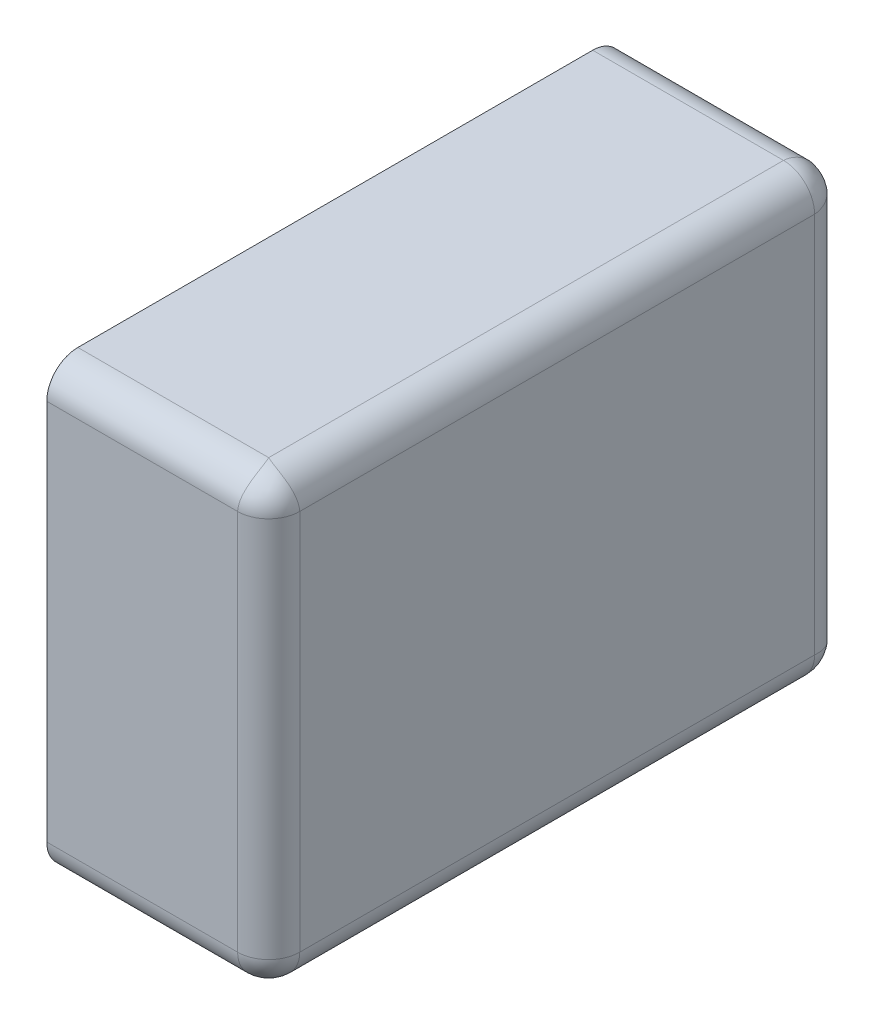
ISO-10303-21;
HEADER;
FILE_DESCRIPTION(('STEP AP214'),'2;1');
FILE_NAME('part.step','',(''),(''),'','','');
FILE_SCHEMA(('AUTOMOTIVE_DESIGN { 1 0 10303 214 1 1 1 1 }'));
ENDSEC;
DATA;
#1=APPLICATION_CONTEXT('core data for automotive mechanical design processes');
#2=APPLICATION_PROTOCOL_DEFINITION('international standard','automotive_design',2000,#1);
#3=PRODUCT_CONTEXT('',#1,'mechanical');
#4=PRODUCT('Part','Part','',(#3));
#5=PRODUCT_RELATED_PRODUCT_CATEGORY('part','',(#4));
#6=PRODUCT_DEFINITION_FORMATION('','',#4);
#7=PRODUCT_DEFINITION_CONTEXT('part definition',#1,'design');
#8=PRODUCT_DEFINITION('design','',#6,#7);
#9=PRODUCT_DEFINITION_SHAPE('','',#8);
#10=(LENGTH_UNIT() NAMED_UNIT(*) SI_UNIT(.MILLI.,.METRE.));
#11=(NAMED_UNIT(*) PLANE_ANGLE_UNIT() SI_UNIT($,.RADIAN.));
#12=(NAMED_UNIT(*) SI_UNIT($,.STERADIAN.) SOLID_ANGLE_UNIT());
#13=UNCERTAINTY_MEASURE_WITH_UNIT(LENGTH_MEASURE(1.E-05),#10,'distance_accuracy_value','');
#14=(GEOMETRIC_REPRESENTATION_CONTEXT(3) GLOBAL_UNCERTAINTY_ASSIGNED_CONTEXT((#13)) GLOBAL_UNIT_ASSIGNED_CONTEXT((#10,
#11,#12)) REPRESENTATION_CONTEXT('',''));
#15=CARTESIAN_POINT('',(0.,0.,0.));
#16=DIRECTION('',(0.,0.,1.));
#17=DIRECTION('',(1.,0.,0.));
#18=AXIS2_PLACEMENT_3D('',#15,#16,#17);
#19=CARTESIAN_POINT('',(0.465,-0.215,0.615));
#20=DIRECTION('',(-0.816496580927726,-0.408248290463863,0.408248290463864));
#21=DIRECTION('',(0.577350269189626,-0.577350269189626,0.577350269189626));
#22=AXIS2_PLACEMENT_3D('',#19,#20,#21);
#23=SPHERICAL_SURFACE('',#22,0.035);
#24=CARTESIAN_POINT('',(0.465,-0.215,0.615));
#25=DIRECTION('',(1.,0.,0.));
#26=DIRECTION('',(0.,-1.,0.));
#27=AXIS2_PLACEMENT_3D('',#24,#25,#26);
#28=CIRCLE('',#27,0.035);
#29=CARTESIAN_POINT('',(0.465,-0.215,0.65));
#30=VERTEX_POINT('',#29);
#31=CARTESIAN_POINT('',(0.465,-0.25,0.615));
#32=VERTEX_POINT('',#31);
#33=EDGE_CURVE('E11',#30,#32,#28,.T.);
#34=ORIENTED_EDGE('',*,*,#33,.T.);
#35=CARTESIAN_POINT('',(0.465,-0.215,0.615));
#36=DIRECTION('',(0.,0.,1.));
#37=DIRECTION('',(1.,0.,0.));
#38=AXIS2_PLACEMENT_3D('',#35,#36,#37);
#39=CIRCLE('',#38,0.035);
#40=CARTESIAN_POINT('',(0.5,-0.215,0.615));
#41=VERTEX_POINT('',#40);
#42=EDGE_CURVE('E24',#32,#41,#39,.T.);
#43=ORIENTED_EDGE('',*,*,#42,.T.);
#44=CARTESIAN_POINT('',(0.465,-0.215,0.615));
#45=DIRECTION('',(0.,-1.,0.));
#46=DIRECTION('',(0.,0.,1.));
#47=AXIS2_PLACEMENT_3D('',#44,#45,#46);
#48=CIRCLE('',#47,0.035);
#49=EDGE_CURVE('E293',#41,#30,#48,.T.);
#50=ORIENTED_EDGE('',*,*,#49,.T.);
#51=EDGE_LOOP('',(#34,#43,#50));
#52=FACE_BOUND('',#51,.T.);
#53=ADVANCED_FACE('F17',(#52),#23,.T.);
#54=CARTESIAN_POINT('',(0.465,-0.215,0.035));
#55=DIRECTION('',(-0.408248290463864,0.408248290463862,-0.816496580927726));
#56=DIRECTION('',(0.577350269189626,-0.577350269189626,-0.577350269189626));
#57=AXIS2_PLACEMENT_3D('',#54,#55,#56);
#58=SPHERICAL_SURFACE('',#57,0.035);
#59=CARTESIAN_POINT('',(0.465,-0.215,0.035));
#60=DIRECTION('',(0.,0.,-1.));
#61=DIRECTION('',(0.,-1.,0.));
#62=AXIS2_PLACEMENT_3D('',#59,#60,#61);
#63=CIRCLE('',#62,0.035);
#64=CARTESIAN_POINT('',(0.5,-0.215,0.035));
#65=VERTEX_POINT('',#64);
#66=CARTESIAN_POINT('',(0.465,-0.25,0.035));
#67=VERTEX_POINT('',#66);
#68=EDGE_CURVE('E294',#65,#67,#63,.T.);
#69=ORIENTED_EDGE('',*,*,#68,.T.);
#70=CARTESIAN_POINT('',(0.465,-0.215,0.035));
#71=DIRECTION('',(1.,0.,0.));
#72=DIRECTION('',(0.,0.,-1.));
#73=AXIS2_PLACEMENT_3D('',#70,#71,#72);
#74=CIRCLE('',#73,0.035);
#75=CARTESIAN_POINT('',(0.465,-0.215,0.));
#76=VERTEX_POINT('',#75);
#77=EDGE_CURVE('E296',#67,#76,#74,.T.);
#78=ORIENTED_EDGE('',*,*,#77,.T.);
#79=CARTESIAN_POINT('',(0.465,-0.215,0.));
#80=CARTESIAN_POINT('',(0.465243740660052,-0.215111612711924,-1.0331312175727E-09));
#81=CARTESIAN_POINT('',(0.465488666732516,-0.215220629481718,3.07994713752332E-06));
#82=CARTESIAN_POINT('',(0.465981520070315,-0.215433885748775,1.54213448005008E-05));
#83=CARTESIAN_POINT('',(0.466229455116116,-0.215538105940278,2.47047353633009E-05));
#84=CARTESIAN_POINT('',(0.466728068059787,-0.215741732728677,4.9512675513181E-05));
#85=CARTESIAN_POINT('',(0.466978752749827,-0.215841119852847,6.50604505245512E-05));
#86=CARTESIAN_POINT('',(0.467482605532488,-0.216035053958947,0.000102452445534108));
#87=CARTESIAN_POINT('',(0.467735779413988,-0.216129581379983,0.000124320072643493));
#88=CARTESIAN_POINT('',(0.468244348899179,-0.216313776392918,0.00017440254172946));
#89=CARTESIAN_POINT('',(0.468499749275707,-0.216403424402807,0.000202640909732523));
#90=CARTESIAN_POINT('',(0.469012507395305,-0.216577848292495,0.000265510172820453));
#91=CARTESIAN_POINT('',(0.469269868886963,-0.216662604636929,0.000300164647462434));
#92=CARTESIAN_POINT('',(0.469786286919367,-0.216827241108787,0.000375907162554588));
#93=CARTESIAN_POINT('',(0.470045346199856,-0.216907101816688,0.000417018776369786));
#94=CARTESIAN_POINT('',(0.470564882823023,-0.217061947217244,0.000505707891539695));
#95=CARTESIAN_POINT('',(0.470825361855251,-0.217136912658727,0.000553308885241226));
#96=CARTESIAN_POINT('',(0.471609968604591,-0.217354908381942,0.000706139736048335));
#97=CARTESIAN_POINT('',(0.472134442299266,-0.217490140608452,0.000820984013978113));
#98=CARTESIAN_POINT('',(0.473185841676211,-0.217741374273634,0.00107673872585381));
#99=CARTESIAN_POINT('',(0.473712757469804,-0.217857228778892,0.00121783256577717));
#100=CARTESIAN_POINT('',(0.474766949596737,-0.218070002263369,0.00152617607159482));
#101=CARTESIAN_POINT('',(0.475294202048866,-0.218166781309575,0.00169360392114075));
#102=CARTESIAN_POINT('',(0.476346926690304,-0.218341794125163,0.00205460359238606));
#103=CARTESIAN_POINT('',(0.476872361926918,-0.218419896278802,0.0022483466915483));
#104=CARTESIAN_POINT('',(0.477919345661508,-0.218558060079502,0.00266187397459508));
#105=CARTESIAN_POINT('',(0.478440845843563,-0.218617999653095,0.00288182110244223));
#106=CARTESIAN_POINT('',(0.479477876626667,-0.218720448187068,0.00334755767046511));
#107=CARTESIAN_POINT('',(0.479993349320268,-0.218762845535282,0.00359350045178805));
#108=CARTESIAN_POINT('',(0.481016280639683,-0.218830922361839,0.00411093349099743));
#109=CARTESIAN_POINT('',(0.48152367372897,-0.218856501350634,0.00438256641507605));
#110=CARTESIAN_POINT('',(0.482528447342334,-0.218891752157373,0.00495098793051569));
#111=CARTESIAN_POINT('',(0.483025756761079,-0.218901334999283,0.00524790763666659));
#112=CARTESIAN_POINT('',(0.484008419811665,-0.218905497314477,0.00586641376765002));
#113=CARTESIAN_POINT('',(0.484493698895198,-0.218899999455456,0.0061881190802628));
#114=CARTESIAN_POINT('',(0.485450421844009,-0.218874991771525,0.00685561052472574));
#115=CARTESIAN_POINT('',(0.485921789865429,-0.218855416137075,0.007201502842692));
#116=CARTESIAN_POINT('',(0.486848883390665,-0.218803325972781,0.00791668610202664));
#117=CARTESIAN_POINT('',(0.487304533887315,-0.218770756798167,0.00828607025275678));
#118=CARTESIAN_POINT('',(0.488198465147439,-0.218693827906318,0.0090474597785677));
#119=CARTESIAN_POINT('',(0.488636673823173,-0.218649424130771,0.00943954530739411));
#120=CARTESIAN_POINT('',(0.489494081877566,-0.218550042880493,0.0102454665261899));
#121=CARTESIAN_POINT('',(0.489913214090433,-0.21849503115435,0.010659369426859));
#122=CARTESIAN_POINT('',(0.490730924439449,-0.218375712170395,0.0115079626417149));
#123=CARTESIAN_POINT('',(0.49112944222653,-0.218311379508136,0.0119427075214747));
#124=CARTESIAN_POINT('',(0.491904480393031,-0.218174750640235,0.0128319326780499));
#125=CARTESIAN_POINT('',(0.492280949002712,-0.218102436759082,0.0132864553513876));
#126=CARTESIAN_POINT('',(0.493010553093937,-0.217951223461324,0.0142140976534304));
#127=CARTESIAN_POINT('',(0.493363646993976,-0.217872312845424,0.0146872481556479));
#128=CARTESIAN_POINT('',(0.49404527918449,-0.217709322047743,0.0156509245104299));
#129=CARTESIAN_POINT('',(0.494373787518085,-0.217625235779704,0.0161414705203753));
#130=CARTESIAN_POINT('',(0.495005144400936,-0.21745333933637,0.0171386367904849));
#131=CARTESIAN_POINT('',(0.495307975865549,-0.21736552673908,0.0176452674495711));
#132=CARTESIAN_POINT('',(0.495886997623915,-0.217187644541206,0.0186732264837271));
#133=CARTESIAN_POINT('',(0.496163184750225,-0.21709757467388,0.0191945565967517));
#134=CARTESIAN_POINT('',(0.496688063108949,-0.216916657514606,0.0202504670074887));
#135=CARTESIAN_POINT('',(0.496936765921816,-0.216825810567597,0.0207850416075391));
#136=CARTESIAN_POINT('',(0.497405950840186,-0.216644822850269,0.0218659272634811));
#137=CARTESIAN_POINT('',(0.497626459881027,-0.216554681484352,0.0224122265262787));
#138=CARTESIAN_POINT('',(0.498038664969825,-0.216376583863148,0.0235149867097744));
#139=CARTESIAN_POINT('',(0.498230403683926,-0.216288624536903,0.0240714311827869));
#140=CARTESIAN_POINT('',(0.498584610279058,-0.216116356585997,0.0251928514102044));
#141=CARTESIAN_POINT('',(0.498747136696717,-0.216032040923638,0.0257578075882803));
#142=CARTESIAN_POINT('',(0.499042596740997,-0.215868503907326,0.0268945709012229));
#143=CARTESIAN_POINT('',(0.499175604674644,-0.215789270127003,0.0274663569255935));
#144=CARTESIAN_POINT('',(0.499411841774386,-0.215637310030175,0.0286150561499456));
#145=CARTESIAN_POINT('',(0.499515160678849,-0.215564564571694,0.0291919483482462));
#146=CARTESIAN_POINT('',(0.49969197165179,-0.215426955223335,0.0303490972435331));
#147=CARTESIAN_POINT('',(0.499765568305483,-0.21536206427015,0.0309293347257464));
#148=CARTESIAN_POINT('',(0.499883016607641,-0.215241491601007,0.0320913854999232));
#149=CARTESIAN_POINT('',(0.499926986895526,-0.215185773836936,0.0326731830258739));
#150=CARTESIAN_POINT('',(0.499985419922284,-0.21508481781809,0.0338365222126202));
#151=CARTESIAN_POINT('',(0.500000014219777,-0.215039533648617,0.034418053300633));
#152=CARTESIAN_POINT('',(0.5,-0.215,0.035));
#153=B_SPLINE_CURVE_WITH_KNOTS('',3,(#79,#80,#81,#82,#83,#84,#85,#86,#87,#88,#89,#90,#91,#92,
#93,#94,#95,#96,#97,#98,#99,#100,#101,#102,#103,#104,#105,#106,#107,#108,#109,#110,#111,#112,
#113,#114,#115,#116,#117,#118,#119,#120,#121,#122,#123,#124,#125,#126,#127,#128,#129,#130,#131,
#132,#133,#134,#135,#136,#137,#138,#139,#140,#141,#142,#143,#144,#145,#146,#147,#148,#149,#150,
#151,#152),.UNSPECIFIED.,.F.,.F.,(4,2,2,2,2,2,2,2,2,2,2,2,2,2,2,2,2,2,2,2,2,2,2,2,2,2,2,2,2,2,2,
2,2,2,2,2,4),(0.,0.000804202894423779,0.00161140112012553,0.00242162001218127,
0.0032348790714814,0.00405119199335703,0.00487056670714096,0.00569300542608977,
0.00651850470709537,0.00817846371619769,0.00985048891785638,0.0115343571056827,
0.0132297631362428,0.0149363236396879,0.0166535810697016,0.0183810080428297,0.0201180119227882,
0.0218639396106709,0.0236180825069813,0.0253796816160159,0.0271479327672721,0.0289219919322404,
0.0307009806181439,0.032483991322942,0.0342700930382171,0.036058336788457,0.0378477611967304,
0.0396373980678723,0.0414262779810541,0.0432134358840202,0.0449979166813544,0.0467787808088676,
0.0485551097856008,0.0503260117339758,0.0520906268573045,0.0538481328621557,0.0555977503109578),.UNSPECIFIED.);
#154=EDGE_CURVE('E227',#76,#65,#153,.T.);
#155=ORIENTED_EDGE('',*,*,#154,.T.);
#156=EDGE_LOOP('',(#69,#78,#155));
#157=FACE_BOUND('',#156,.T.);
#158=ADVANCED_FACE('F233',(#157),#58,.T.);
#159=CARTESIAN_POINT('',(0.3125,-0.215,0.035));
#160=DIRECTION('',(1.,0.,0.));
#161=DIRECTION('',(0.,-0.707106781186547,-0.707106781186548));
#162=AXIS2_PLACEMENT_3D('',#159,#160,#161);
#163=CYLINDRICAL_SURFACE('',#162,0.035);
#164=CARTESIAN_POINT('',(0.25,-0.215,0.035));
#165=DIRECTION('',(1.,0.,0.));
#166=DIRECTION('',(0.,-0.707106781186547,-0.707106781186548));
#167=AXIS2_PLACEMENT_3D('',#164,#165,#166);
#168=CIRCLE('',#167,0.035);
#169=CARTESIAN_POINT('',(0.25,-0.25,0.035));
#170=VERTEX_POINT('',#169);
#171=CARTESIAN_POINT('',(0.25,-0.215,0.));
#172=VERTEX_POINT('',#171);
#173=EDGE_CURVE('E217',#170,#172,#168,.T.);
#174=ORIENTED_EDGE('',*,*,#173,.T.);
#175=DIRECTION('',(1.,0.,0.));
#176=VECTOR('',#175,1.);
#177=CARTESIAN_POINT('',(0.3125,-0.215,0.));
#178=LINE('',#177,#176);
#179=EDGE_CURVE('E303',#172,#76,#178,.T.);
#180=ORIENTED_EDGE('',*,*,#179,.T.);
#181=ORIENTED_EDGE('',*,*,#77,.F.);
#182=DIRECTION('',(-1.,0.,0.));
#183=VECTOR('',#182,1.);
#184=CARTESIAN_POINT('',(0.3125,-0.25,0.035));
#185=LINE('',#184,#183);
#186=EDGE_CURVE('E306',#67,#170,#185,.T.);
#187=ORIENTED_EDGE('',*,*,#186,.T.);
#188=EDGE_LOOP('',(#174,#180,#181,#187));
#189=FACE_BOUND('',#188,.T.);
#190=ADVANCED_FACE('F242',(#189),#163,.T.);
#191=CARTESIAN_POINT('',(0.465,0.215,0.615));
#192=DIRECTION('',(0.408248290463863,-0.816496580927727,0.408248290463861));
#193=DIRECTION('',(0.577350269189626,0.577350269189624,0.577350269189627));
#194=AXIS2_PLACEMENT_3D('',#191,#192,#193);
#195=SPHERICAL_SURFACE('',#194,0.035);
#196=CARTESIAN_POINT('',(0.465,0.215,0.615));
#197=DIRECTION('',(0.,1.,0.));
#198=DIRECTION('',(1.,0.,0.));
#199=AXIS2_PLACEMENT_3D('',#196,#197,#198);
#200=CIRCLE('',#199,0.035);
#201=CARTESIAN_POINT('',(0.465,0.215,0.65));
#202=VERTEX_POINT('',#201);
#203=CARTESIAN_POINT('',(0.5,0.215,0.615));
#204=VERTEX_POINT('',#203);
#205=EDGE_CURVE('E284',#202,#204,#200,.T.);
#206=ORIENTED_EDGE('',*,*,#205,.T.);
#207=CARTESIAN_POINT('',(0.5,0.215,0.615));
#208=CARTESIAN_POINT('',(0.500000014219777,0.215581946699367,0.615039533648617));
#209=CARTESIAN_POINT('',(0.499985419922284,0.21616347778738,0.61508481781809));
#210=CARTESIAN_POINT('',(0.499926986895526,0.217326816974126,0.615185773836936));
#211=CARTESIAN_POINT('',(0.499883016607641,0.217908614500077,0.615241491601007));
#212=CARTESIAN_POINT('',(0.499765568305483,0.219070665274254,0.61536206427015));
#213=CARTESIAN_POINT('',(0.49969197165179,0.219650902756467,0.615426955223335));
#214=CARTESIAN_POINT('',(0.499515160678849,0.220808051651754,0.615564564571695));
#215=CARTESIAN_POINT('',(0.499411841774386,0.221384943850054,0.615637310030175));
#216=CARTESIAN_POINT('',(0.499175604674644,0.222533643074407,0.615789270127003));
#217=CARTESIAN_POINT('',(0.499042596740997,0.223105429098777,0.615868503907326));
#218=CARTESIAN_POINT('',(0.498747136696717,0.22424219241172,0.616032040923638));
#219=CARTESIAN_POINT('',(0.498584610279058,0.224807148589796,0.616116356585997));
#220=CARTESIAN_POINT('',(0.498230403683926,0.225928568817213,0.616288624536903));
#221=CARTESIAN_POINT('',(0.498038664969825,0.226485013290226,0.616376583863148));
#222=CARTESIAN_POINT('',(0.497626459881027,0.227587773473721,0.616554681484352));
#223=CARTESIAN_POINT('',(0.497405950840186,0.228134072736519,0.616644822850269));
#224=CARTESIAN_POINT('',(0.496936765921816,0.229214958392461,0.616825810567597));
#225=CARTESIAN_POINT('',(0.496688063108949,0.229749532992511,0.616916657514606));
#226=CARTESIAN_POINT('',(0.496163184750225,0.230805443403248,0.61709757467388));
#227=CARTESIAN_POINT('',(0.495886997623915,0.231326773516273,0.617187644541206));
#228=CARTESIAN_POINT('',(0.495307975865549,0.232354732550429,0.61736552673908));
#229=CARTESIAN_POINT('',(0.495005144400936,0.232861363209515,0.61745333933637));
#230=CARTESIAN_POINT('',(0.494373787518085,0.233858529479625,0.617625235779704));
#231=CARTESIAN_POINT('',(0.49404527918449,0.23434907548957,0.617709322047743));
#232=CARTESIAN_POINT('',(0.493363646993976,0.235312751844352,0.617872312845424));
#233=CARTESIAN_POINT('',(0.493010553093937,0.23578590234657,0.617951223461324));
#234=CARTESIAN_POINT('',(0.492280949002712,0.236713544648612,0.618102436759082));
#235=CARTESIAN_POINT('',(0.491904480393031,0.23716806732195,0.618174750640235));
#236=CARTESIAN_POINT('',(0.49112944222653,0.238057292478525,0.618311379508136));
#237=CARTESIAN_POINT('',(0.490730924439449,0.238492037358285,0.618375712170395));
#238=CARTESIAN_POINT('',(0.489913214090433,0.239340630573141,0.61849503115435));
#239=CARTESIAN_POINT('',(0.489494081877566,0.23975453347381,0.618550042880493));
#240=CARTESIAN_POINT('',(0.488636673823173,0.240560454692606,0.618649424130772));
#241=CARTESIAN_POINT('',(0.488198465147439,0.240952540221432,0.618693827906318));
#242=CARTESIAN_POINT('',(0.487304533887315,0.241713929747243,0.618770756798168));
#243=CARTESIAN_POINT('',(0.486848883390665,0.242083313897973,0.618803325972781));
#244=CARTESIAN_POINT('',(0.485921789865429,0.242798497157308,0.618855416137075));
#245=CARTESIAN_POINT('',(0.485450421844009,0.243144389475274,0.618874991771525));
#246=CARTESIAN_POINT('',(0.484493698895198,0.243811880919737,0.618899999455456));
#247=CARTESIAN_POINT('',(0.484008419811665,0.24413358623235,0.618905497314477));
#248=CARTESIAN_POINT('',(0.483025756761079,0.244752092363333,0.618901334999283));
#249=CARTESIAN_POINT('',(0.482528447342334,0.245049012069484,0.618891752157372));
#250=CARTESIAN_POINT('',(0.48152367372897,0.245617433584924,0.618856501350634));
#251=CARTESIAN_POINT('',(0.481016280639683,0.245889066509003,0.618830922361839));
#252=CARTESIAN_POINT('',(0.479993349320268,0.246406499548212,0.618762845535282));
#253=CARTESIAN_POINT('',(0.479477876626667,0.246652442329535,0.618720448187068));
#254=CARTESIAN_POINT('',(0.478440845843563,0.247118178897558,0.618617999653095));
#255=CARTESIAN_POINT('',(0.477919345661508,0.247338126025405,0.618558060079502));
#256=CARTESIAN_POINT('',(0.476872361926918,0.247751653308452,0.618419896278803));
#257=CARTESIAN_POINT('',(0.476346926690304,0.247945396407614,0.618341794125163));
#258=CARTESIAN_POINT('',(0.475294202048866,0.248306396078859,0.618166781309575));
#259=CARTESIAN_POINT('',(0.474766949596737,0.248473823928405,0.618070002263369));
#260=CARTESIAN_POINT('',(0.473712757469804,0.248782167434223,0.617857228778892));
#261=CARTESIAN_POINT('',(0.473185841676211,0.248923261274146,0.617741374273634));
#262=CARTESIAN_POINT('',(0.472134442299266,0.249179015986022,0.617490140608452));
#263=CARTESIAN_POINT('',(0.471609968604591,0.249293860263952,0.617354908381942));
#264=CARTESIAN_POINT('',(0.470825361855251,0.249446691114759,0.617136912658727));
#265=CARTESIAN_POINT('',(0.470564882823023,0.24949429210846,0.617061947217244));
#266=CARTESIAN_POINT('',(0.470045346199856,0.24958298122363,0.616907101816688));
#267=CARTESIAN_POINT('',(0.469786286919367,0.249624092837445,0.616827241108787));
#268=CARTESIAN_POINT('',(0.469269868886963,0.249699835352538,0.616662604636929));
#269=CARTESIAN_POINT('',(0.469012507395305,0.24973448982718,0.616577848292495));
#270=CARTESIAN_POINT('',(0.468499749275707,0.249797359090267,0.616403424402807));
#271=CARTESIAN_POINT('',(0.468244348899179,0.249825597458271,0.616313776392918));
#272=CARTESIAN_POINT('',(0.467735779413988,0.249875679927356,0.616129581379983));
#273=CARTESIAN_POINT('',(0.467482605532488,0.249897547554466,0.616035053958947));
#274=CARTESIAN_POINT('',(0.466978752749827,0.249934939549475,0.615841119852847));
#275=CARTESIAN_POINT('',(0.466728068059787,0.249950487324487,0.615741732728677));
#276=CARTESIAN_POINT('',(0.466229455116116,0.249975295264637,0.615538105940278));
#277=CARTESIAN_POINT('',(0.465981520070315,0.2499845786552,0.615433885748775));
#278=CARTESIAN_POINT('',(0.465488666732516,0.249996920052863,0.615220629481718));
#279=CARTESIAN_POINT('',(0.465243740660053,0.250000001033131,0.615111612711924));
#280=CARTESIAN_POINT('',(0.465,0.25,0.615));
#281=B_SPLINE_CURVE_WITH_KNOTS('',3,(#207,#208,#209,#210,#211,#212,#213,#214,#215,#216,#217,
#218,#219,#220,#221,#222,#223,#224,#225,#226,#227,#228,#229,#230,#231,#232,#233,#234,#235,#236,
#237,#238,#239,#240,#241,#242,#243,#244,#245,#246,#247,#248,#249,#250,#251,#252,#253,#254,#255,
#256,#257,#258,#259,#260,#261,#262,#263,#264,#265,#266,#267,#268,#269,#270,#271,#272,#273,#274,
#275,#276,#277,#278,#279,#280),.UNSPECIFIED.,.F.,.F.,(4,2,2,2,2,2,2,2,2,2,2,2,2,2,2,2,2,2,2,2,2,
2,2,2,2,2,2,2,2,2,2,2,2,2,2,2,4),(0.,0.00174961744880201,0.00350712345365322,0.0052717385769819,
0.00704264052535691,0.00881896950209017,0.0105998336296034,0.0123843144269376,
0.0141714723299037,0.0159603522430853,0.0177499891142273,0.0195394135225007,0.0213276572727407,
0.0231137589880158,0.0248967696928138,0.0266757583787174,0.0284498175436857,0.0302180686949419,
0.0319796678039765,0.0337338107002869,0.0354797383881695,0.037216742268128,0.0389441692412561,
0.0406614266712698,0.0423679871747149,0.044063393205275,0.0457472613931013,0.04741928659476,
0.0490792456038623,0.049904744884868,0.0507271836038167,0.0515465583176007,0.0523628712394763,
0.0531761302987764,0.0539863491908321,0.0547935474165339,0.0555977503109577),.UNSPECIFIED.);
#282=CARTESIAN_POINT('',(0.465,0.25,0.615));
#283=VERTEX_POINT('',#282);
#284=EDGE_CURVE('E280',#204,#283,#281,.T.);
#285=ORIENTED_EDGE('',*,*,#284,.T.);
#286=CARTESIAN_POINT('',(0.465,0.25,0.615));
#287=CARTESIAN_POINT('',(0.465111612711924,0.250000001033131,0.615243740660052));
#288=CARTESIAN_POINT('',(0.465220629481718,0.249996920052863,0.615488666732516));
#289=CARTESIAN_POINT('',(0.465433885748775,0.2499845786552,0.615981520070315));
#290=CARTESIAN_POINT('',(0.465538105940278,0.249975295264637,0.616229455116116));
#291=CARTESIAN_POINT('',(0.465741732728677,0.249950487324487,0.616728068059787));
#292=CARTESIAN_POINT('',(0.465841119852847,0.249934939549475,0.616978752749827));
#293=CARTESIAN_POINT('',(0.466035053958947,0.249897547554466,0.617482605532488));
#294=CARTESIAN_POINT('',(0.466129581379983,0.249875679927356,0.617735779413988));
#295=CARTESIAN_POINT('',(0.466313776392918,0.249825597458271,0.618244348899179));
#296=CARTESIAN_POINT('',(0.466403424402808,0.249797359090267,0.618499749275707));
#297=CARTESIAN_POINT('',(0.466577848292495,0.24973448982718,0.619012507395305));
#298=CARTESIAN_POINT('',(0.466662604636929,0.249699835352538,0.619269868886963));
#299=CARTESIAN_POINT('',(0.466827241108787,0.249624092837445,0.619786286919367));
#300=CARTESIAN_POINT('',(0.466907101816688,0.24958298122363,0.620045346199856));
#301=CARTESIAN_POINT('',(0.467061947217244,0.24949429210846,0.620564882823023));
#302=CARTESIAN_POINT('',(0.467136912658727,0.249446691114759,0.620825361855251));
#303=CARTESIAN_POINT('',(0.467354908381942,0.249293860263952,0.621609968604591));
#304=CARTESIAN_POINT('',(0.467490140608452,0.249179015986022,0.622134442299266));
#305=CARTESIAN_POINT('',(0.467741374273634,0.248923261274146,0.623185841676211));
#306=CARTESIAN_POINT('',(0.467857228778892,0.248782167434223,0.623712757469804));
#307=CARTESIAN_POINT('',(0.468070002263369,0.248473823928405,0.624766949596737));
#308=CARTESIAN_POINT('',(0.468166781309575,0.248306396078859,0.625294202048866));
#309=CARTESIAN_POINT('',(0.468341794125163,0.247945396407614,0.626346926690304));
#310=CARTESIAN_POINT('',(0.468419896278802,0.247751653308452,0.626872361926918));
#311=CARTESIAN_POINT('',(0.468558060079502,0.247338126025405,0.627919345661508));
#312=CARTESIAN_POINT('',(0.468617999653095,0.247118178897558,0.628440845843563));
#313=CARTESIAN_POINT('',(0.468720448187068,0.246652442329535,0.629477876626667));
#314=CARTESIAN_POINT('',(0.468762845535282,0.246406499548212,0.629993349320268));
#315=CARTESIAN_POINT('',(0.468830922361839,0.245889066509003,0.631016280639683));
#316=CARTESIAN_POINT('',(0.468856501350634,0.245617433584924,0.63152367372897));
#317=CARTESIAN_POINT('',(0.468891752157373,0.245049012069484,0.632528447342334));
#318=CARTESIAN_POINT('',(0.468901334999283,0.244752092363333,0.633025756761079));
#319=CARTESIAN_POINT('',(0.468905497314477,0.24413358623235,0.634008419811665));
#320=CARTESIAN_POINT('',(0.468899999455456,0.243811880919737,0.634493698895198));
#321=CARTESIAN_POINT('',(0.468874991771525,0.243144389475274,0.635450421844009));
#322=CARTESIAN_POINT('',(0.468855416137075,0.242798497157308,0.635921789865429));
#323=CARTESIAN_POINT('',(0.468803325972781,0.242083313897973,0.636848883390665));
#324=CARTESIAN_POINT('',(0.468770756798167,0.241713929747243,0.637304533887315));
#325=CARTESIAN_POINT('',(0.468693827906318,0.240952540221432,0.638198465147439));
#326=CARTESIAN_POINT('',(0.468649424130771,0.240560454692606,0.638636673823173));
#327=CARTESIAN_POINT('',(0.468550042880493,0.23975453347381,0.639494081877566));
#328=CARTESIAN_POINT('',(0.46849503115435,0.239340630573141,0.639913214090433));
#329=CARTESIAN_POINT('',(0.468375712170395,0.238492037358285,0.640730924439449));
#330=CARTESIAN_POINT('',(0.468311379508136,0.238057292478525,0.64112944222653));
#331=CARTESIAN_POINT('',(0.468174750640235,0.23716806732195,0.641904480393031));
#332=CARTESIAN_POINT('',(0.468102436759082,0.236713544648612,0.642280949002712));
#333=CARTESIAN_POINT('',(0.467951223461324,0.23578590234657,0.643010553093937));
#334=CARTESIAN_POINT('',(0.467872312845424,0.235312751844352,0.643363646993976));
#335=CARTESIAN_POINT('',(0.467709322047743,0.23434907548957,0.64404527918449));
#336=CARTESIAN_POINT('',(0.467625235779704,0.233858529479625,0.644373787518085));
#337=CARTESIAN_POINT('',(0.46745333933637,0.232861363209515,0.645005144400936));
#338=CARTESIAN_POINT('',(0.46736552673908,0.232354732550429,0.645307975865549));
#339=CARTESIAN_POINT('',(0.467187644541206,0.231326773516273,0.645886997623915));
#340=CARTESIAN_POINT('',(0.46709757467388,0.230805443403248,0.646163184750225));
#341=CARTESIAN_POINT('',(0.466916657514606,0.229749532992511,0.646688063108948));
#342=CARTESIAN_POINT('',(0.466825810567597,0.229214958392461,0.646936765921816));
#343=CARTESIAN_POINT('',(0.466644822850269,0.228134072736519,0.647405950840186));
#344=CARTESIAN_POINT('',(0.466554681484352,0.227587773473721,0.647626459881027));
#345=CARTESIAN_POINT('',(0.466376583863148,0.226485013290226,0.648038664969825));
#346=CARTESIAN_POINT('',(0.466288624536903,0.225928568817213,0.648230403683926));
#347=CARTESIAN_POINT('',(0.466116356585997,0.224807148589796,0.648584610279058));
#348=CARTESIAN_POINT('',(0.466032040923638,0.22424219241172,0.648747136696717));
#349=CARTESIAN_POINT('',(0.465868503907326,0.223105429098777,0.649042596740997));
#350=CARTESIAN_POINT('',(0.465789270127003,0.222533643074407,0.649175604674644));
#351=CARTESIAN_POINT('',(0.465637310030175,0.221384943850054,0.649411841774386));
#352=CARTESIAN_POINT('',(0.465564564571695,0.220808051651754,0.649515160678849));
#353=CARTESIAN_POINT('',(0.465426955223335,0.219650902756467,0.64969197165179));
#354=CARTESIAN_POINT('',(0.46536206427015,0.219070665274254,0.649765568305483));
#355=CARTESIAN_POINT('',(0.465241491601007,0.217908614500077,0.64988301660764));
#356=CARTESIAN_POINT('',(0.465185773836936,0.217326816974126,0.649926986895526));
#357=CARTESIAN_POINT('',(0.46508481781809,0.21616347778738,0.649985419922284));
#358=CARTESIAN_POINT('',(0.465039533648617,0.215581946699367,0.650000014219777));
#359=CARTESIAN_POINT('',(0.465,0.215,0.65));
#360=B_SPLINE_CURVE_WITH_KNOTS('',3,(#286,#287,#288,#289,#290,#291,#292,#293,#294,#295,#296,
#297,#298,#299,#300,#301,#302,#303,#304,#305,#306,#307,#308,#309,#310,#311,#312,#313,#314,#315,
#316,#317,#318,#319,#320,#321,#322,#323,#324,#325,#326,#327,#328,#329,#330,#331,#332,#333,#334,
#335,#336,#337,#338,#339,#340,#341,#342,#343,#344,#345,#346,#347,#348,#349,#350,#351,#352,#353,
#354,#355,#356,#357,#358,#359),.UNSPECIFIED.,.F.,.F.,(4,2,2,2,2,2,2,2,2,2,2,2,2,2,2,2,2,2,2,2,2,
2,2,2,2,2,2,2,2,2,2,2,2,2,2,2,4),(0.,0.000804202894423741,0.00161140112012554,
0.00242162001218123,0.00323487907148142,0.00405119199335704,0.00487056670714097,
0.00569300542608968,0.00651850470709528,0.0081784637161977,0.00985048891785633,
0.0115343571056826,0.0132297631362427,0.0149363236396878,0.0166535810697015,0.0183810080428296,
0.0201180119227881,0.0218639396106708,0.0236180825069812,0.0253796816160157,0.027147932767272,
0.0289219919322403,0.0307009806181438,0.0324839913229419,0.0342700930382169,0.0360583367884569,
0.0378477611967303,0.0396373980678722,0.0414262779810539,0.0432134358840201,0.0449979166813542,
0.0467787808088675,0.0485551097856007,0.0503260117339757,0.0520906268573044,0.0538481328621556,
0.0555977503109576),.UNSPECIFIED.);
#361=EDGE_CURVE('E270',#283,#202,#360,.T.);
#362=ORIENTED_EDGE('',*,*,#361,.T.);
#363=EDGE_LOOP('',(#206,#285,#362));
#364=FACE_BOUND('',#363,.T.);
#365=ADVANCED_FACE('F245',(#364),#195,.T.);
#366=CARTESIAN_POINT('',(0.465,0.215,0.035));
#367=DIRECTION('',(-0.408248290463864,-0.408248290463862,-0.816496580927726));
#368=DIRECTION('',(0.577350269189626,0.577350269189625,-0.577350269189626));
#369=AXIS2_PLACEMENT_3D('',#366,#367,#368);
#370=SPHERICAL_SURFACE('',#369,0.035);
#371=CARTESIAN_POINT('',(0.465,0.215,0.035));
#372=DIRECTION('',(0.,0.,-1.));
#373=DIRECTION('',(1.,0.,0.));
#374=AXIS2_PLACEMENT_3D('',#371,#372,#373);
#375=CIRCLE('',#374,0.035);
#376=CARTESIAN_POINT('',(0.465,0.25,0.035));
#377=VERTEX_POINT('',#376);
#378=CARTESIAN_POINT('',(0.5,0.215,0.035));
#379=VERTEX_POINT('',#378);
#380=EDGE_CURVE('E330',#377,#379,#375,.T.);
#381=ORIENTED_EDGE('',*,*,#380,.T.);
#382=CARTESIAN_POINT('',(0.5,0.215,0.035));
#383=CARTESIAN_POINT('',(0.500000014219777,0.215039533648617,0.034418053300633));
#384=CARTESIAN_POINT('',(0.499985419922284,0.21508481781809,0.0338365222126202));
#385=CARTESIAN_POINT('',(0.499926986895526,0.215185773836936,0.0326731830258739));
#386=CARTESIAN_POINT('',(0.499883016607641,0.215241491601007,0.0320913854999232));
#387=CARTESIAN_POINT('',(0.499765568305483,0.21536206427015,0.0309293347257464));
#388=CARTESIAN_POINT('',(0.49969197165179,0.215426955223335,0.0303490972435331));
#389=CARTESIAN_POINT('',(0.499515160678849,0.215564564571694,0.0291919483482462));
#390=CARTESIAN_POINT('',(0.499411841774386,0.215637310030175,0.0286150561499456));
#391=CARTESIAN_POINT('',(0.499175604674644,0.215789270127003,0.0274663569255934));
#392=CARTESIAN_POINT('',(0.499042596740997,0.215868503907326,0.0268945709012229));
#393=CARTESIAN_POINT('',(0.498747136696717,0.216032040923638,0.0257578075882802));
#394=CARTESIAN_POINT('',(0.498584610279058,0.216116356585997,0.0251928514102044));
#395=CARTESIAN_POINT('',(0.498230403683926,0.216288624536903,0.0240714311827869));
#396=CARTESIAN_POINT('',(0.498038664969825,0.216376583863148,0.0235149867097744));
#397=CARTESIAN_POINT('',(0.497626459881027,0.216554681484352,0.0224122265262787));
#398=CARTESIAN_POINT('',(0.497405950840186,0.216644822850269,0.0218659272634811));
#399=CARTESIAN_POINT('',(0.496936765921816,0.216825810567597,0.0207850416075391));
#400=CARTESIAN_POINT('',(0.496688063108949,0.216916657514606,0.0202504670074887));
#401=CARTESIAN_POINT('',(0.496163184750225,0.21709757467388,0.0191945565967516));
#402=CARTESIAN_POINT('',(0.495886997623915,0.217187644541206,0.0186732264837271));
#403=CARTESIAN_POINT('',(0.495307975865549,0.21736552673908,0.0176452674495711));
#404=CARTESIAN_POINT('',(0.495005144400936,0.21745333933637,0.0171386367904849));
#405=CARTESIAN_POINT('',(0.494373787518085,0.217625235779704,0.0161414705203753));
#406=CARTESIAN_POINT('',(0.49404527918449,0.217709322047743,0.0156509245104299));
#407=CARTESIAN_POINT('',(0.493363646993976,0.217872312845424,0.0146872481556479));
#408=CARTESIAN_POINT('',(0.493010553093937,0.217951223461324,0.0142140976534304));
#409=CARTESIAN_POINT('',(0.492280949002712,0.218102436759082,0.0132864553513876));
#410=CARTESIAN_POINT('',(0.491904480393031,0.218174750640235,0.0128319326780499));
#411=CARTESIAN_POINT('',(0.49112944222653,0.218311379508136,0.0119427075214746));
#412=CARTESIAN_POINT('',(0.490730924439449,0.218375712170395,0.0115079626417149));
#413=CARTESIAN_POINT('',(0.489913214090433,0.21849503115435,0.010659369426859));
#414=CARTESIAN_POINT('',(0.489494081877566,0.218550042880493,0.0102454665261899));
#415=CARTESIAN_POINT('',(0.488636673823173,0.218649424130771,0.0094395453073941));
#416=CARTESIAN_POINT('',(0.488198465147439,0.218693827906318,0.00904745977856766));
#417=CARTESIAN_POINT('',(0.487304533887315,0.218770756798167,0.00828607025275674));
#418=CARTESIAN_POINT('',(0.486848883390665,0.218803325972781,0.00791668610202662));
#419=CARTESIAN_POINT('',(0.485921789865429,0.218855416137075,0.00720150284269199));
#420=CARTESIAN_POINT('',(0.485450421844009,0.218874991771525,0.00685561052472573));
#421=CARTESIAN_POINT('',(0.484493698895198,0.218899999455456,0.00618811908026279));
#422=CARTESIAN_POINT('',(0.484008419811665,0.218905497314477,0.00586641376765002));
#423=CARTESIAN_POINT('',(0.483025756761079,0.218901334999283,0.00524790763666659));
#424=CARTESIAN_POINT('',(0.482528447342334,0.218891752157372,0.0049509879305157));
#425=CARTESIAN_POINT('',(0.48152367372897,0.218856501350634,0.00438256641507607));
#426=CARTESIAN_POINT('',(0.481016280639683,0.218830922361839,0.00411093349099745));
#427=CARTESIAN_POINT('',(0.479993349320268,0.218762845535282,0.00359350045178807));
#428=CARTESIAN_POINT('',(0.479477876626667,0.218720448187068,0.00334755767046512));
#429=CARTESIAN_POINT('',(0.478440845843563,0.218617999653095,0.00288182110244224));
#430=CARTESIAN_POINT('',(0.477919345661508,0.218558060079502,0.00266187397459509));
#431=CARTESIAN_POINT('',(0.476872361926918,0.218419896278802,0.0022483466915483));
#432=CARTESIAN_POINT('',(0.476346926690304,0.218341794125163,0.00205460359238605));
#433=CARTESIAN_POINT('',(0.475294202048866,0.218166781309575,0.00169360392114075));
#434=CARTESIAN_POINT('',(0.474766949596737,0.218070002263369,0.00152617607159482));
#435=CARTESIAN_POINT('',(0.473712757469804,0.217857228778892,0.00121783256577716));
#436=CARTESIAN_POINT('',(0.473185841676211,0.217741374273634,0.0010767387258538));
#437=CARTESIAN_POINT('',(0.472134442299266,0.217490140608452,0.00082098401397811));
#438=CARTESIAN_POINT('',(0.471609968604591,0.217354908381942,0.000706139736048336));
#439=CARTESIAN_POINT('',(0.470825361855251,0.217136912658727,0.000553308885241227));
#440=CARTESIAN_POINT('',(0.470564882823023,0.217061947217244,0.000505707891539695));
#441=CARTESIAN_POINT('',(0.470045346199856,0.216907101816688,0.000417018776369788));
#442=CARTESIAN_POINT('',(0.469786286919367,0.216827241108787,0.000375907162554592));
#443=CARTESIAN_POINT('',(0.469269868886963,0.216662604636929,0.000300164647462441));
#444=CARTESIAN_POINT('',(0.469012507395305,0.216577848292495,0.000265510172820459));
#445=CARTESIAN_POINT('',(0.468499749275707,0.216403424402807,0.00020264090973253));
#446=CARTESIAN_POINT('',(0.468244348899179,0.216313776392918,0.000174402541729468));
#447=CARTESIAN_POINT('',(0.467735779413988,0.216129581379983,0.000124320072643499));
#448=CARTESIAN_POINT('',(0.467482605532488,0.216035053958947,0.00010245244553411));
#449=CARTESIAN_POINT('',(0.466978752749827,0.215841119852847,6.50604505245502E-05));
#450=CARTESIAN_POINT('',(0.466728068059787,0.215741732728677,4.95126755131801E-05));
#451=CARTESIAN_POINT('',(0.466229455116116,0.215538105940278,2.47047353632997E-05));
#452=CARTESIAN_POINT('',(0.465981520070315,0.215433885748775,1.54213448005002E-05));
#453=CARTESIAN_POINT('',(0.465488666732516,0.215220629481718,3.07994713752507E-06));
#454=CARTESIAN_POINT('',(0.465243740660052,0.215111612711924,-1.03313121520424E-09));
#455=CARTESIAN_POINT('',(0.465,0.215,0.));
#456=B_SPLINE_CURVE_WITH_KNOTS('',3,(#382,#383,#384,#385,#386,#387,#388,#389,#390,#391,#392,
#393,#394,#395,#396,#397,#398,#399,#400,#401,#402,#403,#404,#405,#406,#407,#408,#409,#410,#411,
#412,#413,#414,#415,#416,#417,#418,#419,#420,#421,#422,#423,#424,#425,#426,#427,#428,#429,#430,
#431,#432,#433,#434,#435,#436,#437,#438,#439,#440,#441,#442,#443,#444,#445,#446,#447,#448,#449,
#450,#451,#452,#453,#454,#455),.UNSPECIFIED.,.F.,.F.,(4,2,2,2,2,2,2,2,2,2,2,2,2,2,2,2,2,2,2,2,2,
2,2,2,2,2,2,2,2,2,2,2,2,2,2,2,4),(0.,0.00174961744880199,0.00350712345365321,
0.00527173857698189,0.00704264052535691,0.00881896950209018,0.0105998336296034,
0.0123843144269376,0.0141714723299037,0.0159603522430853,0.0177499891142273,0.0195394135225007,
0.0213276572727407,0.0231137589880158,0.0248967696928138,0.0266757583787174,0.0284498175436857,
0.0302180686949419,0.0319796678039764,0.0337338107002869,0.0354797383881695,0.037216742268128,
0.0389441692412561,0.0406614266712698,0.042367987174715,0.044063393205275,0.0457472613931014,
0.04741928659476,0.0490792456038624,0.049904744884868,0.0507271836038167,0.0515465583176007,
0.0523628712394763,0.0531761302987764,0.0539863491908321,0.054793547416534,0.0555977503109577),.UNSPECIFIED.);
#457=CARTESIAN_POINT('',(0.465,0.215,0.));
#458=VERTEX_POINT('',#457);
#459=EDGE_CURVE('E326',#379,#458,#456,.T.);
#460=ORIENTED_EDGE('',*,*,#459,.T.);
#461=CARTESIAN_POINT('',(0.465,0.215,0.));
#462=CARTESIAN_POINT('',(0.465111612711924,0.215243740660052,-1.03313121586323E-09));
#463=CARTESIAN_POINT('',(0.465220629481718,0.215488666732516,3.07994713752451E-06));
#464=CARTESIAN_POINT('',(0.465433885748775,0.215981520070315,1.54213448005003E-05));
#465=CARTESIAN_POINT('',(0.465538105940278,0.216229455116116,2.47047353632999E-05));
#466=CARTESIAN_POINT('',(0.465741732728677,0.216728068059787,4.95126755131809E-05));
#467=CARTESIAN_POINT('',(0.465841119852847,0.216978752749827,6.50604505245519E-05));
#468=CARTESIAN_POINT('',(0.466035053958947,0.217482605532488,0.000102452445534109));
#469=CARTESIAN_POINT('',(0.466129581379983,0.217735779413988,0.000124320072643493));
#470=CARTESIAN_POINT('',(0.466313776392918,0.218244348899179,0.000174402541729459));
#471=CARTESIAN_POINT('',(0.466403424402808,0.218499749275707,0.000202640909732521));
#472=CARTESIAN_POINT('',(0.466577848292495,0.219012507395305,0.000265510172820455));
#473=CARTESIAN_POINT('',(0.466662604636929,0.219269868886962,0.000300164647462441));
#474=CARTESIAN_POINT('',(0.466827241108787,0.219786286919367,0.000375907162554594));
#475=CARTESIAN_POINT('',(0.466907101816688,0.220045346199856,0.000417018776369787));
#476=CARTESIAN_POINT('',(0.467061947217244,0.220564882823023,0.000505707891539695));
#477=CARTESIAN_POINT('',(0.467136912658727,0.220825361855251,0.00055330888524123));
#478=CARTESIAN_POINT('',(0.467354908381942,0.221609968604591,0.000706139736048348));
#479=CARTESIAN_POINT('',(0.467490140608452,0.222134442299266,0.000820984013978128));
#480=CARTESIAN_POINT('',(0.467741374273634,0.223185841676211,0.00107673872585382));
#481=CARTESIAN_POINT('',(0.467857228778892,0.223712757469804,0.00121783256577717));
#482=CARTESIAN_POINT('',(0.468070002263369,0.224766949596737,0.00152617607159482));
#483=CARTESIAN_POINT('',(0.468166781309575,0.225294202048866,0.00169360392114075));
#484=CARTESIAN_POINT('',(0.468341794125163,0.226346926690304,0.00205460359238606));
#485=CARTESIAN_POINT('',(0.468419896278802,0.226872361926918,0.0022483466915483));
#486=CARTESIAN_POINT('',(0.468558060079502,0.227919345661508,0.00266187397459509));
#487=CARTESIAN_POINT('',(0.468617999653095,0.228440845843563,0.00288182110244224));
#488=CARTESIAN_POINT('',(0.468720448187068,0.229477876626666,0.00334755767046512));
#489=CARTESIAN_POINT('',(0.468762845535282,0.229993349320268,0.00359350045178805));
#490=CARTESIAN_POINT('',(0.468830922361839,0.231016280639683,0.00411093349099743));
#491=CARTESIAN_POINT('',(0.468856501350634,0.23152367372897,0.00438256641507605));
#492=CARTESIAN_POINT('',(0.468891752157373,0.232528447342334,0.00495098793051569));
#493=CARTESIAN_POINT('',(0.468901334999283,0.233025756761079,0.00524790763666659));
#494=CARTESIAN_POINT('',(0.468905497314477,0.234008419811665,0.00586641376765002));
#495=CARTESIAN_POINT('',(0.468899999455456,0.234493698895198,0.00618811908026279));
#496=CARTESIAN_POINT('',(0.468874991771525,0.235450421844009,0.00685561052472573));
#497=CARTESIAN_POINT('',(0.468855416137075,0.235921789865429,0.007201502842692));
#498=CARTESIAN_POINT('',(0.468803325972781,0.236848883390665,0.00791668610202664));
#499=CARTESIAN_POINT('',(0.468770756798167,0.237304533887315,0.00828607025275677));
#500=CARTESIAN_POINT('',(0.468693827906318,0.238198465147439,0.00904745977856769));
#501=CARTESIAN_POINT('',(0.468649424130771,0.238636673823173,0.00943954530739411));
#502=CARTESIAN_POINT('',(0.468550042880493,0.239494081877566,0.0102454665261899));
#503=CARTESIAN_POINT('',(0.46849503115435,0.239913214090433,0.010659369426859));
#504=CARTESIAN_POINT('',(0.468375712170396,0.240730924439449,0.0115079626417149));
#505=CARTESIAN_POINT('',(0.468311379508136,0.24112944222653,0.0119427075214746));
#506=CARTESIAN_POINT('',(0.468174750640235,0.241904480393031,0.0128319326780499));
#507=CARTESIAN_POINT('',(0.468102436759082,0.242280949002712,0.0132864553513876));
#508=CARTESIAN_POINT('',(0.467951223461324,0.243010553093937,0.0142140976534304));
#509=CARTESIAN_POINT('',(0.467872312845424,0.243363646993975,0.0146872481556479));
#510=CARTESIAN_POINT('',(0.467709322047743,0.24404527918449,0.0156509245104299));
#511=CARTESIAN_POINT('',(0.467625235779704,0.244373787518085,0.0161414705203753));
#512=CARTESIAN_POINT('',(0.46745333933637,0.245005144400936,0.0171386367904849));
#513=CARTESIAN_POINT('',(0.46736552673908,0.245307975865549,0.017645267449571));
#514=CARTESIAN_POINT('',(0.467187644541206,0.245886997623915,0.0186732264837271));
#515=CARTESIAN_POINT('',(0.46709757467388,0.246163184750225,0.0191945565967516));
#516=CARTESIAN_POINT('',(0.466916657514606,0.246688063108948,0.0202504670074887));
#517=CARTESIAN_POINT('',(0.466825810567597,0.246936765921816,0.020785041607539));
#518=CARTESIAN_POINT('',(0.466644822850269,0.247405950840186,0.0218659272634811));
#519=CARTESIAN_POINT('',(0.466554681484352,0.247626459881027,0.0224122265262787));
#520=CARTESIAN_POINT('',(0.466376583863148,0.248038664969825,0.0235149867097744));
#521=CARTESIAN_POINT('',(0.466288624536903,0.248230403683926,0.0240714311827869));
#522=CARTESIAN_POINT('',(0.466116356585997,0.248584610279058,0.0251928514102044));
#523=CARTESIAN_POINT('',(0.466032040923638,0.248747136696717,0.0257578075882802));
#524=CARTESIAN_POINT('',(0.465868503907326,0.249042596740997,0.0268945709012229));
#525=CARTESIAN_POINT('',(0.465789270127003,0.249175604674644,0.0274663569255934));
#526=CARTESIAN_POINT('',(0.465637310030175,0.249411841774386,0.0286150561499456));
#527=CARTESIAN_POINT('',(0.465564564571695,0.249515160678849,0.0291919483482462));
#528=CARTESIAN_POINT('',(0.465426955223335,0.24969197165179,0.030349097243533));
#529=CARTESIAN_POINT('',(0.46536206427015,0.249765568305483,0.0309293347257463));
#530=CARTESIAN_POINT('',(0.465241491601007,0.249883016607641,0.0320913854999232));
#531=CARTESIAN_POINT('',(0.465185773836936,0.249926986895526,0.0326731830258738));
#532=CARTESIAN_POINT('',(0.46508481781809,0.249985419922284,0.0338365222126201));
#533=CARTESIAN_POINT('',(0.465039533648617,0.250000014219777,0.034418053300633));
#534=CARTESIAN_POINT('',(0.465,0.25,0.035));
#535=B_SPLINE_CURVE_WITH_KNOTS('',3,(#461,#462,#463,#464,#465,#466,#467,#468,#469,#470,#471,
#472,#473,#474,#475,#476,#477,#478,#479,#480,#481,#482,#483,#484,#485,#486,#487,#488,#489,#490,
#491,#492,#493,#494,#495,#496,#497,#498,#499,#500,#501,#502,#503,#504,#505,#506,#507,#508,#509,
#510,#511,#512,#513,#514,#515,#516,#517,#518,#519,#520,#521,#522,#523,#524,#525,#526,#527,#528,
#529,#530,#531,#532,#533,#534),.UNSPECIFIED.,.F.,.F.,(4,2,2,2,2,2,2,2,2,2,2,2,2,2,2,2,2,2,2,2,2,
2,2,2,2,2,2,2,2,2,2,2,2,2,2,2,4),(0.,0.000804202894423741,0.00161140112012554,
0.00242162001218125,0.00323487907148142,0.00405119199335701,0.00487056670714094,
0.00569300542608973,0.00651850470709533,0.00817846371619768,0.00985048891785636,
0.0115343571056827,0.0132297631362427,0.0149363236396878,0.0166535810697015,0.0183810080428296,
0.0201180119227882,0.0218639396106708,0.0236180825069812,0.0253796816160158,0.027147932767272,
0.0289219919322403,0.0307009806181439,0.0324839913229419,0.034270093038217,0.036058336788457,
0.0378477611967303,0.0396373980678723,0.041426277981054,0.0432134358840201,0.0449979166813543,
0.0467787808088675,0.0485551097856007,0.0503260117339757,0.0520906268573044,0.0538481328621556,
0.0555977503109577),.UNSPECIFIED.);
#536=EDGE_CURVE('E177',#458,#377,#535,.T.);
#537=ORIENTED_EDGE('',*,*,#536,.T.);
#538=EDGE_LOOP('',(#381,#460,#537));
#539=FACE_BOUND('',#538,.T.);
#540=ADVANCED_FACE('F202',(#539),#370,.T.);
#541=CARTESIAN_POINT('',(0.465,-0.125,0.035));
#542=DIRECTION('',(0.,1.,0.));
#543=DIRECTION('',(0.707106781186548,0.,-0.707106781186547));
#544=AXIS2_PLACEMENT_3D('',#541,#542,#543);
#545=CYLINDRICAL_SURFACE('',#544,0.035);
#546=ORIENTED_EDGE('',*,*,#459,.F.);
#547=DIRECTION('',(0.,-1.,0.));
#548=VECTOR('',#547,1.);
#549=CARTESIAN_POINT('',(0.5,-0.125,0.035));
#550=LINE('',#549,#548);
#551=EDGE_CURVE('E172',#379,#65,#550,.T.);
#552=ORIENTED_EDGE('',*,*,#551,.T.);
#553=ORIENTED_EDGE('',*,*,#154,.F.);
#554=DIRECTION('',(0.,1.,0.));
#555=VECTOR('',#554,1.);
#556=CARTESIAN_POINT('',(0.465,-0.125,0.));
#557=LINE('',#556,#555);
#558=EDGE_CURVE('E167',#76,#458,#557,.T.);
#559=ORIENTED_EDGE('',*,*,#558,.T.);
#560=EDGE_LOOP('',(#546,#552,#553,#559));
#561=FACE_BOUND('',#560,.T.);
#562=ADVANCED_FACE('F195',(#561),#545,.T.);
#563=CARTESIAN_POINT('',(0.4375,0.215,0.035));
#564=DIRECTION('',(-1.,0.,0.));
#565=DIRECTION('',(0.,0.707106781186547,-0.707106781186548));
#566=AXIS2_PLACEMENT_3D('',#563,#564,#565);
#567=CYLINDRICAL_SURFACE('',#566,0.035);
#568=CARTESIAN_POINT('',(0.25,0.215,0.035));
#569=DIRECTION('',(1.,0.,0.));
#570=DIRECTION('',(0.,0.707106781186547,-0.707106781186548));
#571=AXIS2_PLACEMENT_3D('',#568,#569,#570);
#572=CIRCLE('',#571,0.035);
#573=CARTESIAN_POINT('',(0.25,0.215,0.));
#574=VERTEX_POINT('',#573);
#575=CARTESIAN_POINT('',(0.25,0.25,0.035));
#576=VERTEX_POINT('',#575);
#577=EDGE_CURVE('E165',#574,#576,#572,.T.);
#578=ORIENTED_EDGE('',*,*,#577,.T.);
#579=DIRECTION('',(1.,0.,0.));
#580=VECTOR('',#579,1.);
#581=CARTESIAN_POINT('',(0.4375,0.25,0.035));
#582=LINE('',#581,#580);
#583=EDGE_CURVE('E160',#576,#377,#582,.T.);
#584=ORIENTED_EDGE('',*,*,#583,.T.);
#585=ORIENTED_EDGE('',*,*,#536,.F.);
#586=DIRECTION('',(-1.,0.,0.));
#587=VECTOR('',#586,1.);
#588=CARTESIAN_POINT('',(0.4375,0.215,0.));
#589=LINE('',#588,#587);
#590=EDGE_CURVE('E155',#458,#574,#589,.T.);
#591=ORIENTED_EDGE('',*,*,#590,.T.);
#592=EDGE_LOOP('',(#578,#584,#585,#591));
#593=FACE_BOUND('',#592,.T.);
#594=ADVANCED_FACE('F184',(#593),#567,.T.);
#595=CARTESIAN_POINT('',(0.465,0.215,0.));
#596=DIRECTION('',(0.,0.,1.));
#597=DIRECTION('',(0.707106781186548,0.707106781186547,0.));
#598=AXIS2_PLACEMENT_3D('',#595,#596,#597);
#599=CYLINDRICAL_SURFACE('',#598,0.035);
#600=ORIENTED_EDGE('',*,*,#284,.F.);
#601=DIRECTION('',(0.,0.,-1.));
#602=VECTOR('',#601,1.);
#603=CARTESIAN_POINT('',(0.5,0.215,0.));
#604=LINE('',#603,#602);
#605=EDGE_CURVE('E150',#204,#379,#604,.T.);
#606=ORIENTED_EDGE('',*,*,#605,.T.);
#607=ORIENTED_EDGE('',*,*,#380,.F.);
#608=DIRECTION('',(0.,0.,1.));
#609=VECTOR('',#608,1.);
#610=CARTESIAN_POINT('',(0.465,0.25,0.));
#611=LINE('',#610,#609);
#612=EDGE_CURVE('E145',#377,#283,#611,.T.);
#613=ORIENTED_EDGE('',*,*,#612,.T.);
#614=EDGE_LOOP('',(#600,#606,#607,#613));
#615=FACE_BOUND('',#614,.T.);
#616=ADVANCED_FACE('F194',(#615),#599,.T.);
#617=CARTESIAN_POINT('',(0.4375,0.215,0.615));
#618=DIRECTION('',(-1.,0.,0.));
#619=DIRECTION('',(0.,0.707106781186547,0.707106781186548));
#620=AXIS2_PLACEMENT_3D('',#617,#618,#619);
#621=CYLINDRICAL_SURFACE('',#620,0.035);
#622=CARTESIAN_POINT('',(0.25,0.215,0.615));
#623=DIRECTION('',(1.,0.,0.));
#624=DIRECTION('',(0.,0.707106781186547,0.707106781186548));
#625=AXIS2_PLACEMENT_3D('',#622,#623,#624);
#626=CIRCLE('',#625,0.035);
#627=CARTESIAN_POINT('',(0.25,0.25,0.615));
#628=VERTEX_POINT('',#627);
#629=CARTESIAN_POINT('',(0.25,0.215,0.65));
#630=VERTEX_POINT('',#629);
#631=EDGE_CURVE('E143',#628,#630,#626,.T.);
#632=ORIENTED_EDGE('',*,*,#631,.T.);
#633=DIRECTION('',(1.,0.,0.));
#634=VECTOR('',#633,1.);
#635=CARTESIAN_POINT('',(0.4375,0.215,0.65));
#636=LINE('',#635,#634);
#637=EDGE_CURVE('E109',#630,#202,#636,.T.);
#638=ORIENTED_EDGE('',*,*,#637,.T.);
#639=ORIENTED_EDGE('',*,*,#361,.F.);
#640=DIRECTION('',(-1.,0.,0.));
#641=VECTOR('',#640,1.);
#642=CARTESIAN_POINT('',(0.4375,0.25,0.615));
#643=LINE('',#642,#641);
#644=EDGE_CURVE('E135',#283,#628,#643,.T.);
#645=ORIENTED_EDGE('',*,*,#644,.T.);
#646=EDGE_LOOP('',(#632,#638,#639,#645));
#647=FACE_BOUND('',#646,.T.);
#648=ADVANCED_FACE('F344',(#647),#621,.T.);
#649=CARTESIAN_POINT('',(0.465,-0.125,0.615));
#650=DIRECTION('',(0.,1.,0.));
#651=DIRECTION('',(0.707106781186548,0.,0.707106781186548));
#652=AXIS2_PLACEMENT_3D('',#649,#650,#651);
#653=CYLINDRICAL_SURFACE('',#652,0.035);
#654=ORIENTED_EDGE('',*,*,#205,.F.);
#655=DIRECTION('',(0.,-1.,0.));
#656=VECTOR('',#655,1.);
#657=CARTESIAN_POINT('',(0.465,-0.125,0.65));
#658=LINE('',#657,#656);
#659=EDGE_CURVE('E130',#202,#30,#658,.T.);
#660=ORIENTED_EDGE('',*,*,#659,.T.);
#661=ORIENTED_EDGE('',*,*,#49,.F.);
#662=DIRECTION('',(0.,1.,0.));
#663=VECTOR('',#662,1.);
#664=CARTESIAN_POINT('',(0.5,-0.125,0.615));
#665=LINE('',#664,#663);
#666=EDGE_CURVE('E125',#41,#204,#665,.T.);
#667=ORIENTED_EDGE('',*,*,#666,.T.);
#668=EDGE_LOOP('',(#654,#660,#661,#667));
#669=FACE_BOUND('',#668,.T.);
#670=ADVANCED_FACE('F292',(#669),#653,.T.);
#671=CARTESIAN_POINT('',(0.465,-0.215,0.));
#672=DIRECTION('',(0.,0.,1.));
#673=DIRECTION('',(0.707106781186548,-0.707106781186548,0.));
#674=AXIS2_PLACEMENT_3D('',#671,#672,#673);
#675=CYLINDRICAL_SURFACE('',#674,0.035);
#676=ORIENTED_EDGE('',*,*,#42,.F.);
#677=DIRECTION('',(0.,0.,-1.));
#678=VECTOR('',#677,1.);
#679=CARTESIAN_POINT('',(0.465,-0.25,0.));
#680=LINE('',#679,#678);
#681=EDGE_CURVE('E122',#32,#67,#680,.T.);
#682=ORIENTED_EDGE('',*,*,#681,.T.);
#683=ORIENTED_EDGE('',*,*,#68,.F.);
#684=DIRECTION('',(0.,0.,1.));
#685=VECTOR('',#684,1.);
#686=CARTESIAN_POINT('',(0.5,-0.215,0.));
#687=LINE('',#686,#685);
#688=EDGE_CURVE('E97',#65,#41,#687,.T.);
#689=ORIENTED_EDGE('',*,*,#688,.T.);
#690=EDGE_LOOP('',(#676,#682,#683,#689));
#691=FACE_BOUND('',#690,.T.);
#692=ADVANCED_FACE('F356',(#691),#675,.T.);
#693=CARTESIAN_POINT('',(0.3125,-0.215,0.615));
#694=DIRECTION('',(1.,0.,0.));
#695=DIRECTION('',(0.,-0.707106781186547,0.707106781186548));
#696=AXIS2_PLACEMENT_3D('',#693,#694,#695);
#697=CYLINDRICAL_SURFACE('',#696,0.035);
#698=CARTESIAN_POINT('',(0.25,-0.215,0.615));
#699=DIRECTION('',(1.,0.,0.));
#700=DIRECTION('',(0.,-0.707106781186547,0.707106781186548));
#701=AXIS2_PLACEMENT_3D('',#698,#699,#700);
#702=CIRCLE('',#701,0.035);
#703=CARTESIAN_POINT('',(0.25,-0.215,0.65));
#704=VERTEX_POINT('',#703);
#705=CARTESIAN_POINT('',(0.25,-0.25,0.615));
#706=VERTEX_POINT('',#705);
#707=EDGE_CURVE('E90',#704,#706,#702,.T.);
#708=ORIENTED_EDGE('',*,*,#707,.T.);
#709=DIRECTION('',(1.,0.,0.));
#710=VECTOR('',#709,1.);
#711=CARTESIAN_POINT('',(0.3125,-0.25,0.615));
#712=LINE('',#711,#710);
#713=EDGE_CURVE('E98',#706,#32,#712,.T.);
#714=ORIENTED_EDGE('',*,*,#713,.T.);
#715=ORIENTED_EDGE('',*,*,#33,.F.);
#716=DIRECTION('',(-1.,0.,0.));
#717=VECTOR('',#716,1.);
#718=CARTESIAN_POINT('',(0.3125,-0.215,0.65));
#719=LINE('',#718,#717);
#720=EDGE_CURVE('E101',#30,#704,#719,.T.);
#721=ORIENTED_EDGE('',*,*,#720,.T.);
#722=EDGE_LOOP('',(#708,#714,#715,#721));
#723=FACE_BOUND('',#722,.T.);
#724=ADVANCED_FACE('F102',(#723),#697,.T.);
#725=CARTESIAN_POINT('',(0.375,0.,0.65));
#726=DIRECTION('',(0.,0.,1.));
#727=DIRECTION('',(1.,0.,0.));
#728=AXIS2_PLACEMENT_3D('',#725,#726,#727);
#729=PLANE('',#728);
#730=ORIENTED_EDGE('',*,*,#720,.F.);
#731=ORIENTED_EDGE('',*,*,#659,.F.);
#732=ORIENTED_EDGE('',*,*,#637,.F.);
#733=DIRECTION('',(0.,-1.,0.));
#734=VECTOR('',#733,1.);
#735=CARTESIAN_POINT('',(0.25,0.25,0.65));
#736=LINE('',#735,#734);
#737=EDGE_CURVE('E93',#630,#704,#736,.T.);
#738=ORIENTED_EDGE('',*,*,#737,.T.);
#739=EDGE_LOOP('',(#730,#731,#732,#738));
#740=FACE_BOUND('',#739,.T.);
#741=ADVANCED_FACE('F107',(#740),#729,.T.);
#742=CARTESIAN_POINT('',(0.5,0.25,0.));
#743=DIRECTION('',(0.,1.,0.));
#744=DIRECTION('',(-1.,0.,0.));
#745=AXIS2_PLACEMENT_3D('',#742,#743,#744);
#746=PLANE('',#745);
#747=ORIENTED_EDGE('',*,*,#644,.F.);
#748=ORIENTED_EDGE('',*,*,#612,.F.);
#749=ORIENTED_EDGE('',*,*,#583,.F.);
#750=DIRECTION('',(0.,0.,1.));
#751=VECTOR('',#750,1.);
#752=CARTESIAN_POINT('',(0.25,0.25,0.));
#753=LINE('',#752,#751);
#754=EDGE_CURVE('E110',#576,#628,#753,.T.);
#755=ORIENTED_EDGE('',*,*,#754,.T.);
#756=EDGE_LOOP('',(#747,#748,#749,#755));
#757=FACE_BOUND('',#756,.T.);
#758=ADVANCED_FACE('F364',(#757),#746,.T.);
#759=CARTESIAN_POINT('',(0.25,0.25,0.));
#760=DIRECTION('',(-1.,0.,0.));
#761=DIRECTION('',(0.,-1.,0.));
#762=AXIS2_PLACEMENT_3D('',#759,#760,#761);
#763=PLANE('',#762);
#764=ORIENTED_EDGE('',*,*,#707,.F.);
#765=ORIENTED_EDGE('',*,*,#737,.F.);
#766=ORIENTED_EDGE('',*,*,#631,.F.);
#767=ORIENTED_EDGE('',*,*,#754,.F.);
#768=ORIENTED_EDGE('',*,*,#577,.F.);
#769=DIRECTION('',(0.,-1.,0.));
#770=VECTOR('',#769,1.);
#771=CARTESIAN_POINT('',(0.25,0.25,0.));
#772=LINE('',#771,#770);
#773=EDGE_CURVE('E113',#574,#172,#772,.T.);
#774=ORIENTED_EDGE('',*,*,#773,.T.);
#775=ORIENTED_EDGE('',*,*,#173,.F.);
#776=DIRECTION('',(0.,0.,1.));
#777=VECTOR('',#776,1.);
#778=CARTESIAN_POINT('',(0.25,-0.25,0.));
#779=LINE('',#778,#777);
#780=EDGE_CURVE('E95',#170,#706,#779,.T.);
#781=ORIENTED_EDGE('',*,*,#780,.T.);
#782=EDGE_LOOP('',(#764,#765,#766,#767,#768,#774,#775,#781));
#783=FACE_BOUND('',#782,.T.);
#784=ADVANCED_FACE('F91',(#783),#763,.T.);
#785=CARTESIAN_POINT('',(0.5,-0.25,0.));
#786=DIRECTION('',(1.,0.,0.));
#787=DIRECTION('',(0.,1.,0.));
#788=AXIS2_PLACEMENT_3D('',#785,#786,#787);
#789=PLANE('',#788);
#790=ORIENTED_EDGE('',*,*,#551,.F.);
#791=ORIENTED_EDGE('',*,*,#605,.F.);
#792=ORIENTED_EDGE('',*,*,#666,.F.);
#793=ORIENTED_EDGE('',*,*,#688,.F.);
#794=EDGE_LOOP('',(#790,#791,#792,#793));
#795=FACE_BOUND('',#794,.T.);
#796=ADVANCED_FACE('F288',(#795),#789,.T.);
#797=CARTESIAN_POINT('',(0.25,-0.25,0.));
#798=DIRECTION('',(0.,-1.,0.));
#799=DIRECTION('',(1.,0.,0.));
#800=AXIS2_PLACEMENT_3D('',#797,#798,#799);
#801=PLANE('',#800);
#802=ORIENTED_EDGE('',*,*,#713,.F.);
#803=ORIENTED_EDGE('',*,*,#780,.F.);
#804=ORIENTED_EDGE('',*,*,#186,.F.);
#805=ORIENTED_EDGE('',*,*,#681,.F.);
#806=EDGE_LOOP('',(#802,#803,#804,#805));
#807=FACE_BOUND('',#806,.T.);
#808=ADVANCED_FACE('F317',(#807),#801,.T.);
#809=CARTESIAN_POINT('',(0.375,0.,0.));
#810=DIRECTION('',(0.,0.,1.));
#811=DIRECTION('',(1.,0.,0.));
#812=AXIS2_PLACEMENT_3D('',#809,#810,#811);
#813=PLANE('',#812);
#814=ORIENTED_EDGE('',*,*,#179,.F.);
#815=ORIENTED_EDGE('',*,*,#773,.F.);
#816=ORIENTED_EDGE('',*,*,#590,.F.);
#817=ORIENTED_EDGE('',*,*,#558,.F.);
#818=EDGE_LOOP('',(#814,#815,#816,#817));
#819=FACE_BOUND('',#818,.T.);
#820=ADVANCED_FACE('F324',(#819),#813,.F.);
#821=CLOSED_SHELL('',(#53,#158,#190,#365,#540,#562,#594,#616,#648,#670,#692,#724,#741,#758,#784,
#796,#808,#820));
#822=MANIFOLD_SOLID_BREP('B1',#821);
#823=ADVANCED_BREP_SHAPE_REPRESENTATION('',(#18,#822),#14);
#824=SHAPE_DEFINITION_REPRESENTATION(#9,#823);
ENDSEC;
END-ISO-10303-21;
